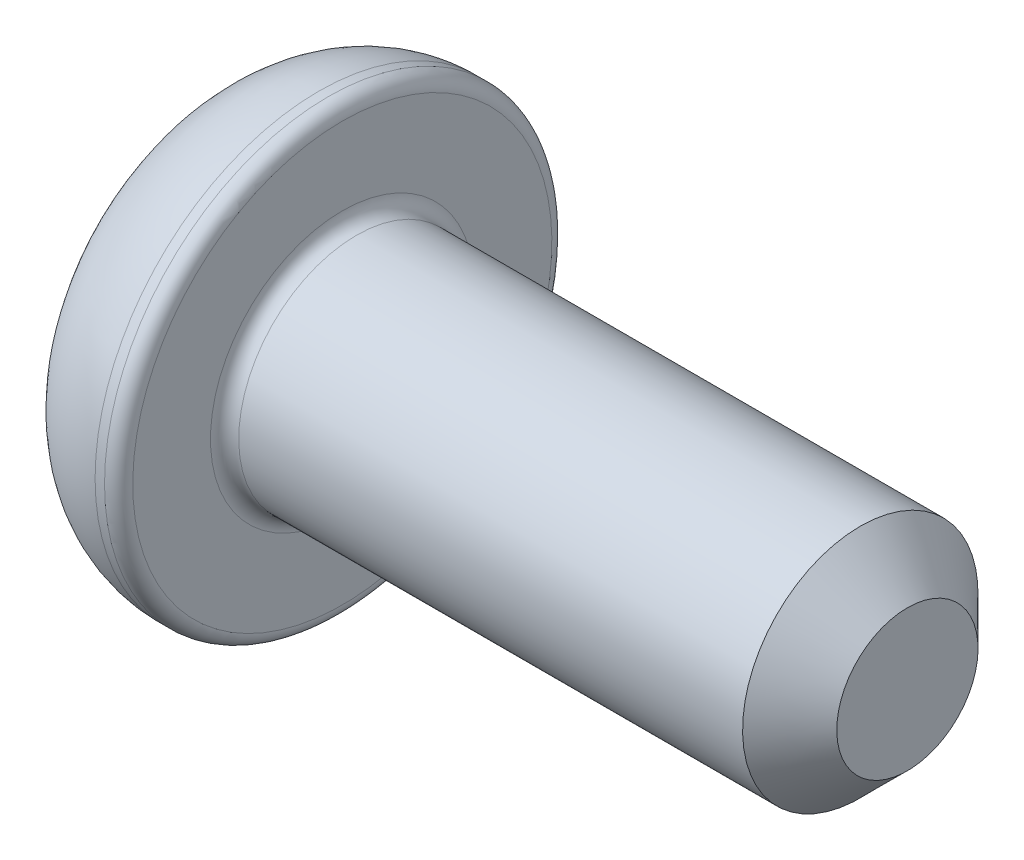
ISO-10303-21;
HEADER;
FILE_DESCRIPTION(('STEP AP214'),'2;1');
FILE_NAME('part.step','',(''),(''),'','','');
FILE_SCHEMA(('AUTOMOTIVE_DESIGN { 1 0 10303 214 1 1 1 1 }'));
ENDSEC;
DATA;
#1=APPLICATION_CONTEXT('core data for automotive mechanical design processes');
#2=APPLICATION_PROTOCOL_DEFINITION('international standard','automotive_design',2000,#1);
#3=PRODUCT_CONTEXT('',#1,'mechanical');
#4=PRODUCT('Part','Part','',(#3));
#5=PRODUCT_RELATED_PRODUCT_CATEGORY('part','',(#4));
#6=PRODUCT_DEFINITION_FORMATION('','',#4);
#7=PRODUCT_DEFINITION_CONTEXT('part definition',#1,'design');
#8=PRODUCT_DEFINITION('design','',#6,#7);
#9=PRODUCT_DEFINITION_SHAPE('','',#8);
#10=(LENGTH_UNIT() NAMED_UNIT(*) SI_UNIT(.MILLI.,.METRE.));
#11=(NAMED_UNIT(*) PLANE_ANGLE_UNIT() SI_UNIT($,.RADIAN.));
#12=(NAMED_UNIT(*) SI_UNIT($,.STERADIAN.) SOLID_ANGLE_UNIT());
#13=UNCERTAINTY_MEASURE_WITH_UNIT(LENGTH_MEASURE(1.E-05),#10,'distance_accuracy_value','');
#14=(GEOMETRIC_REPRESENTATION_CONTEXT(3) GLOBAL_UNCERTAINTY_ASSIGNED_CONTEXT((#13)) GLOBAL_UNIT_ASSIGNED_CONTEXT((#10,
#11,#12)) REPRESENTATION_CONTEXT('',''));
#15=CARTESIAN_POINT('',(0.,0.,0.));
#16=DIRECTION('',(0.,0.,1.));
#17=DIRECTION('',(1.,0.,0.));
#18=AXIS2_PLACEMENT_3D('',#15,#16,#17);
#19=CARTESIAN_POINT('',(0.,0.,0.));
#20=DIRECTION('',(-1.,0.,0.));
#21=DIRECTION('',(0.,-1.,0.));
#22=AXIS2_PLACEMENT_3D('',#19,#20,#21);
#23=PLANE('',#22);
#24=DIRECTION('',(0.,0.866025403784438,-0.5));
#25=VECTOR('',#24,1.);
#26=CARTESIAN_POINT('',(0.,0.,1.73205080756888));
#27=LINE('',#26,#25);
#28=CARTESIAN_POINT('',(0.,0.,1.73205080756888));
#29=VERTEX_POINT('',#28);
#30=CARTESIAN_POINT('',(0.,1.5,0.866025403784438));
#31=VERTEX_POINT('',#30);
#32=EDGE_CURVE('E55',#29,#31,#27,.T.);
#33=ORIENTED_EDGE('',*,*,#32,.F.);
#34=DIRECTION('',(0.,0.866025403784439,0.5));
#35=VECTOR('',#34,1.);
#36=CARTESIAN_POINT('',(0.,-1.5,0.866025403784438));
#37=LINE('',#36,#35);
#38=CARTESIAN_POINT('',(0.,-1.5,0.866025403784438));
#39=VERTEX_POINT('',#38);
#40=EDGE_CURVE('E138',#39,#29,#37,.T.);
#41=ORIENTED_EDGE('',*,*,#40,.F.);
#42=DIRECTION('',(0.,0.,1.));
#43=VECTOR('',#42,1.);
#44=CARTESIAN_POINT('',(0.,-1.5,-0.866025403784439));
#45=LINE('',#44,#43);
#46=CARTESIAN_POINT('',(0.,-1.5,-0.866025403784439));
#47=VERTEX_POINT('',#46);
#48=EDGE_CURVE('E136',#47,#39,#45,.T.);
#49=ORIENTED_EDGE('',*,*,#48,.F.);
#50=DIRECTION('',(0.,-0.866025403784438,0.5));
#51=VECTOR('',#50,1.);
#52=CARTESIAN_POINT('',(0.,0.,-1.73205080756888));
#53=LINE('',#52,#51);
#54=CARTESIAN_POINT('',(0.,0.,-1.73205080756888));
#55=VERTEX_POINT('',#54);
#56=EDGE_CURVE('E103',#55,#47,#53,.T.);
#57=ORIENTED_EDGE('',*,*,#56,.F.);
#58=DIRECTION('',(0.,-0.866025403784439,-0.5));
#59=VECTOR('',#58,1.);
#60=CARTESIAN_POINT('',(0.,1.5,-0.866025403784439));
#61=LINE('',#60,#59);
#62=CARTESIAN_POINT('',(0.,1.5,-0.866025403784439));
#63=VERTEX_POINT('',#62);
#64=EDGE_CURVE('E132',#63,#55,#61,.T.);
#65=ORIENTED_EDGE('',*,*,#64,.F.);
#66=DIRECTION('',(0.,0.,-1.));
#67=VECTOR('',#66,1.);
#68=CARTESIAN_POINT('',(0.,1.5,0.866025403784438));
#69=LINE('',#68,#67);
#70=EDGE_CURVE('E129',#31,#63,#69,.T.);
#71=ORIENTED_EDGE('',*,*,#70,.F.);
#72=EDGE_LOOP('',(#33,#41,#49,#57,#65,#71));
#73=FACE_BOUND('',#72,.T.);
#74=CARTESIAN_POINT('',(0.,0.,0.));
#75=DIRECTION('',(1.,0.,0.));
#76=DIRECTION('',(0.,1.,0.));
#77=AXIS2_PLACEMENT_3D('',#74,#75,#76);
#78=CIRCLE('',#77,3.625);
#79=CARTESIAN_POINT('',(0.,3.625,0.));
#80=VERTEX_POINT('',#79);
#81=EDGE_CURVE('E150',#80,#80,#78,.T.);
#82=ORIENTED_EDGE('',*,*,#81,.F.);
#83=EDGE_LOOP('',(#82));
#84=FACE_BOUND('',#83,.T.);
#85=ADVANCED_FACE('F39',(#73,#84),#23,.T.);
#86=CARTESIAN_POINT('',(2.1,0.,0.));
#87=DIRECTION('',(1.,0.,0.));
#88=DIRECTION('',(0.,1.,0.));
#89=AXIS2_PLACEMENT_3D('',#86,#87,#88);
#90=DEGENERATE_TOROIDAL_SURFACE('',#89,2.2275,2.5225,.T.);
#91=ORIENTED_EDGE('',*,*,#81,.T.);
#92=EDGE_LOOP('',(#91));
#93=FACE_BOUND('',#92,.T.);
#94=CARTESIAN_POINT('',(2.1,0.,0.));
#95=DIRECTION('',(1.,0.,0.));
#96=DIRECTION('',(0.,1.,0.));
#97=AXIS2_PLACEMENT_3D('',#94,#95,#96);
#98=CIRCLE('',#97,4.75);
#99=CARTESIAN_POINT('',(2.1,4.75,0.));
#100=VERTEX_POINT('',#99);
#101=EDGE_CURVE('E142',#100,#100,#98,.T.);
#102=ORIENTED_EDGE('',*,*,#101,.F.);
#103=EDGE_LOOP('',(#102));
#104=FACE_BOUND('',#103,.T.);
#105=ADVANCED_FACE('F179',(#93,#104),#90,.T.);
#106=CARTESIAN_POINT('',(14.6,0.,0.));
#107=DIRECTION('',(1.,0.,0.));
#108=DIRECTION('',(0.,1.,0.));
#109=AXIS2_PLACEMENT_3D('',#106,#107,#108);
#110=CYLINDRICAL_SURFACE('',#109,4.75);
#111=CARTESIAN_POINT('',(2.3,0.,0.));
#112=DIRECTION('',(1.,0.,0.));
#113=DIRECTION('',(0.,1.,0.));
#114=AXIS2_PLACEMENT_3D('',#111,#112,#113);
#115=CIRCLE('',#114,4.75);
#116=CARTESIAN_POINT('',(2.3,4.75,0.));
#117=VERTEX_POINT('',#116);
#118=EDGE_CURVE('E162',#117,#117,#115,.F.);
#119=ORIENTED_EDGE('',*,*,#118,.T.);
#120=EDGE_LOOP('',(#119));
#121=FACE_BOUND('',#120,.T.);
#122=ORIENTED_EDGE('',*,*,#101,.T.);
#123=EDGE_LOOP('',(#122));
#124=FACE_BOUND('',#123,.T.);
#125=ADVANCED_FACE('F185',(#121,#124),#110,.T.);
#126=CARTESIAN_POINT('',(2.6,4.75,0.));
#127=DIRECTION('',(1.,0.,0.));
#128=DIRECTION('',(0.,1.,0.));
#129=AXIS2_PLACEMENT_3D('',#126,#127,#128);
#130=PLANE('',#129);
#131=CARTESIAN_POINT('',(2.6,0.,0.));
#132=DIRECTION('',(1.,0.,0.));
#133=DIRECTION('',(0.,1.,0.));
#134=AXIS2_PLACEMENT_3D('',#131,#132,#133);
#135=CIRCLE('',#134,2.8);
#136=CARTESIAN_POINT('',(2.6,2.8,0.));
#137=VERTEX_POINT('',#136);
#138=EDGE_CURVE('E159',#137,#137,#135,.F.);
#139=ORIENTED_EDGE('',*,*,#138,.T.);
#140=EDGE_LOOP('',(#139));
#141=FACE_BOUND('',#140,.T.);
#142=CARTESIAN_POINT('',(2.6,0.,0.));
#143=DIRECTION('',(1.,0.,0.));
#144=DIRECTION('',(0.,1.,0.));
#145=AXIS2_PLACEMENT_3D('',#142,#143,#144);
#146=CIRCLE('',#145,4.45);
#147=CARTESIAN_POINT('',(2.6,4.45,0.));
#148=VERTEX_POINT('',#147);
#149=EDGE_CURVE('E156',#148,#148,#146,.T.);
#150=ORIENTED_EDGE('',*,*,#149,.T.);
#151=EDGE_LOOP('',(#150));
#152=FACE_BOUND('',#151,.T.);
#153=ADVANCED_FACE('F204',(#141,#152),#130,.T.);
#154=CARTESIAN_POINT('',(14.6,0.,0.));
#155=DIRECTION('',(1.,0.,0.));
#156=DIRECTION('',(0.,1.,0.));
#157=AXIS2_PLACEMENT_3D('',#154,#155,#156);
#158=CYLINDRICAL_SURFACE('',#157,2.5);
#159=CARTESIAN_POINT('',(13.6,0.,0.));
#160=DIRECTION('',(1.,0.,0.));
#161=DIRECTION('',(0.,1.,0.));
#162=AXIS2_PLACEMENT_3D('',#159,#160,#161);
#163=CIRCLE('',#162,2.5);
#164=CARTESIAN_POINT('',(13.6,2.5,0.));
#165=VERTEX_POINT('',#164);
#166=EDGE_CURVE('E11',#165,#165,#163,.F.);
#167=ORIENTED_EDGE('',*,*,#166,.T.);
#168=EDGE_LOOP('',(#167));
#169=FACE_BOUND('',#168,.T.);
#170=CARTESIAN_POINT('',(2.9,0.,0.));
#171=DIRECTION('',(1.,0.,0.));
#172=DIRECTION('',(0.,1.,0.));
#173=AXIS2_PLACEMENT_3D('',#170,#171,#172);
#174=CIRCLE('',#173,2.5);
#175=CARTESIAN_POINT('',(2.9,2.5,0.));
#176=VERTEX_POINT('',#175);
#177=EDGE_CURVE('E153',#176,#176,#174,.T.);
#178=ORIENTED_EDGE('',*,*,#177,.T.);
#179=EDGE_LOOP('',(#178));
#180=FACE_BOUND('',#179,.T.);
#181=ADVANCED_FACE('F202',(#169,#180),#158,.T.);
#182=CARTESIAN_POINT('',(14.6,2.5,0.));
#183=DIRECTION('',(1.,0.,0.));
#184=DIRECTION('',(0.,1.,0.));
#185=AXIS2_PLACEMENT_3D('',#182,#183,#184);
#186=PLANE('',#185);
#187=CARTESIAN_POINT('',(14.6,0.,0.));
#188=DIRECTION('',(1.,0.,0.));
#189=DIRECTION('',(0.,1.,0.));
#190=AXIS2_PLACEMENT_3D('',#187,#188,#189);
#191=CIRCLE('',#190,1.5);
#192=CARTESIAN_POINT('',(14.6,1.5,0.));
#193=VERTEX_POINT('',#192);
#194=EDGE_CURVE('E48',#193,#193,#191,.T.);
#195=ORIENTED_EDGE('',*,*,#194,.T.);
#196=EDGE_LOOP('',(#195));
#197=FACE_BOUND('',#196,.T.);
#198=ADVANCED_FACE('F167',(#197),#186,.T.);
#199=CARTESIAN_POINT('',(1.5,0.,1.73205080756888));
#200=DIRECTION('',(0.,0.5,0.866025403784439));
#201=DIRECTION('',(0.,-0.866025403784439,0.5));
#202=AXIS2_PLACEMENT_3D('',#199,#200,#201);
#203=PLANE('',#202);
#204=ORIENTED_EDGE('',*,*,#32,.T.);
#205=DIRECTION('',(-1.,0.,0.));
#206=VECTOR('',#205,1.);
#207=CARTESIAN_POINT('',(1.5,1.5,0.866025403784438));
#208=LINE('',#207,#206);
#209=CARTESIAN_POINT('',(1.5,1.5,0.866025403784438));
#210=VERTEX_POINT('',#209);
#211=EDGE_CURVE('E85',#210,#31,#208,.T.);
#212=ORIENTED_EDGE('',*,*,#211,.F.);
#213=DIRECTION('',(0.,0.866025403784438,-0.5));
#214=VECTOR('',#213,1.);
#215=CARTESIAN_POINT('',(1.5,0.,1.73205080756888));
#216=LINE('',#215,#214);
#217=CARTESIAN_POINT('',(1.5,0.,1.73205080756888));
#218=VERTEX_POINT('',#217);
#219=EDGE_CURVE('E140',#218,#210,#216,.T.);
#220=ORIENTED_EDGE('',*,*,#219,.F.);
#221=DIRECTION('',(-1.,0.,0.));
#222=VECTOR('',#221,1.);
#223=CARTESIAN_POINT('',(1.5,0.,1.73205080756888));
#224=LINE('',#223,#222);
#225=EDGE_CURVE('E63',#218,#29,#224,.T.);
#226=ORIENTED_EDGE('',*,*,#225,.T.);
#227=EDGE_LOOP('',(#204,#212,#220,#226));
#228=FACE_BOUND('',#227,.T.);
#229=ADVANCED_FACE('F211',(#228),#203,.F.);
#230=CARTESIAN_POINT('',(1.5,-1.5,0.866025403784438));
#231=DIRECTION('',(0.,-0.5,0.866025403784438));
#232=DIRECTION('',(0.,-0.866025403784439,-0.5));
#233=AXIS2_PLACEMENT_3D('',#230,#231,#232);
#234=PLANE('',#233);
#235=ORIENTED_EDGE('',*,*,#40,.T.);
#236=ORIENTED_EDGE('',*,*,#225,.F.);
#237=DIRECTION('',(0.,0.866025403784439,0.5));
#238=VECTOR('',#237,1.);
#239=CARTESIAN_POINT('',(1.5,-1.5,0.866025403784438));
#240=LINE('',#239,#238);
#241=CARTESIAN_POINT('',(1.5,-1.5,0.866025403784438));
#242=VERTEX_POINT('',#241);
#243=EDGE_CURVE('E115',#242,#218,#240,.T.);
#244=ORIENTED_EDGE('',*,*,#243,.F.);
#245=DIRECTION('',(-1.,0.,0.));
#246=VECTOR('',#245,1.);
#247=CARTESIAN_POINT('',(1.5,-1.5,0.866025403784438));
#248=LINE('',#247,#246);
#249=EDGE_CURVE('E107',#242,#39,#248,.T.);
#250=ORIENTED_EDGE('',*,*,#249,.T.);
#251=EDGE_LOOP('',(#235,#236,#244,#250));
#252=FACE_BOUND('',#251,.T.);
#253=ADVANCED_FACE('F270',(#252),#234,.F.);
#254=CARTESIAN_POINT('',(1.5,-1.5,-0.866025403784439));
#255=DIRECTION('',(0.,-1.,0.));
#256=DIRECTION('',(0.,0.,-1.));
#257=AXIS2_PLACEMENT_3D('',#254,#255,#256);
#258=PLANE('',#257);
#259=ORIENTED_EDGE('',*,*,#48,.T.);
#260=ORIENTED_EDGE('',*,*,#249,.F.);
#261=DIRECTION('',(0.,0.,1.));
#262=VECTOR('',#261,1.);
#263=CARTESIAN_POINT('',(1.5,-1.5,-0.866025403784439));
#264=LINE('',#263,#262);
#265=CARTESIAN_POINT('',(1.5,-1.5,-0.866025403784439));
#266=VERTEX_POINT('',#265);
#267=EDGE_CURVE('E111',#266,#242,#264,.T.);
#268=ORIENTED_EDGE('',*,*,#267,.F.);
#269=DIRECTION('',(-1.,0.,0.));
#270=VECTOR('',#269,1.);
#271=CARTESIAN_POINT('',(1.5,-1.5,-0.866025403784439));
#272=LINE('',#271,#270);
#273=EDGE_CURVE('E96',#266,#47,#272,.T.);
#274=ORIENTED_EDGE('',*,*,#273,.T.);
#275=EDGE_LOOP('',(#259,#260,#268,#274));
#276=FACE_BOUND('',#275,.T.);
#277=ADVANCED_FACE('F112',(#276),#258,.F.);
#278=CARTESIAN_POINT('',(1.5,0.,-1.73205080756888));
#279=DIRECTION('',(0.,-0.5,-0.866025403784439));
#280=DIRECTION('',(0.,0.866025403784439,-0.5));
#281=AXIS2_PLACEMENT_3D('',#278,#279,#280);
#282=PLANE('',#281);
#283=ORIENTED_EDGE('',*,*,#56,.T.);
#284=ORIENTED_EDGE('',*,*,#273,.F.);
#285=DIRECTION('',(0.,-0.866025403784438,0.5));
#286=VECTOR('',#285,1.);
#287=CARTESIAN_POINT('',(1.5,0.,-1.73205080756888));
#288=LINE('',#287,#286);
#289=CARTESIAN_POINT('',(1.5,0.,-1.73205080756888));
#290=VERTEX_POINT('',#289);
#291=EDGE_CURVE('E100',#290,#266,#288,.T.);
#292=ORIENTED_EDGE('',*,*,#291,.F.);
#293=DIRECTION('',(-1.,0.,0.));
#294=VECTOR('',#293,1.);
#295=CARTESIAN_POINT('',(1.5,0.,-1.73205080756888));
#296=LINE('',#295,#294);
#297=EDGE_CURVE('E108',#290,#55,#296,.T.);
#298=ORIENTED_EDGE('',*,*,#297,.T.);
#299=EDGE_LOOP('',(#283,#284,#292,#298));
#300=FACE_BOUND('',#299,.T.);
#301=ADVANCED_FACE('F98',(#300),#282,.F.);
#302=CARTESIAN_POINT('',(1.5,1.5,-0.866025403784439));
#303=DIRECTION('',(0.,0.5,-0.866025403784439));
#304=DIRECTION('',(0.,0.866025403784439,0.5));
#305=AXIS2_PLACEMENT_3D('',#302,#303,#304);
#306=PLANE('',#305);
#307=ORIENTED_EDGE('',*,*,#64,.T.);
#308=ORIENTED_EDGE('',*,*,#297,.F.);
#309=DIRECTION('',(0.,-0.866025403784439,-0.5));
#310=VECTOR('',#309,1.);
#311=CARTESIAN_POINT('',(1.5,1.5,-0.866025403784439));
#312=LINE('',#311,#310);
#313=CARTESIAN_POINT('',(1.5,1.5,-0.866025403784439));
#314=VERTEX_POINT('',#313);
#315=EDGE_CURVE('E121',#314,#290,#312,.T.);
#316=ORIENTED_EDGE('',*,*,#315,.F.);
#317=DIRECTION('',(-1.,0.,0.));
#318=VECTOR('',#317,1.);
#319=CARTESIAN_POINT('',(1.5,1.5,-0.866025403784439));
#320=LINE('',#319,#318);
#321=EDGE_CURVE('E145',#314,#63,#320,.T.);
#322=ORIENTED_EDGE('',*,*,#321,.T.);
#323=EDGE_LOOP('',(#307,#308,#316,#322));
#324=FACE_BOUND('',#323,.T.);
#325=ADVANCED_FACE('F287',(#324),#306,.F.);
#326=CARTESIAN_POINT('',(1.5,1.5,0.866025403784438));
#327=DIRECTION('',(0.,1.,0.));
#328=DIRECTION('',(0.,0.,1.));
#329=AXIS2_PLACEMENT_3D('',#326,#327,#328);
#330=PLANE('',#329);
#331=ORIENTED_EDGE('',*,*,#70,.T.);
#332=ORIENTED_EDGE('',*,*,#321,.F.);
#333=DIRECTION('',(0.,0.,-1.));
#334=VECTOR('',#333,1.);
#335=CARTESIAN_POINT('',(1.5,1.5,0.866025403784438));
#336=LINE('',#335,#334);
#337=EDGE_CURVE('E123',#210,#314,#336,.T.);
#338=ORIENTED_EDGE('',*,*,#337,.F.);
#339=ORIENTED_EDGE('',*,*,#211,.T.);
#340=EDGE_LOOP('',(#331,#332,#338,#339));
#341=FACE_BOUND('',#340,.T.);
#342=ADVANCED_FACE('F196',(#341),#330,.F.);
#343=CARTESIAN_POINT('',(1.5,0.,0.));
#344=DIRECTION('',(-1.,0.,0.));
#345=DIRECTION('',(0.,0.,1.));
#346=AXIS2_PLACEMENT_3D('',#343,#344,#345);
#347=PLANE('',#346);
#348=ORIENTED_EDGE('',*,*,#219,.T.);
#349=ORIENTED_EDGE('',*,*,#337,.T.);
#350=ORIENTED_EDGE('',*,*,#315,.T.);
#351=ORIENTED_EDGE('',*,*,#291,.T.);
#352=ORIENTED_EDGE('',*,*,#267,.T.);
#353=ORIENTED_EDGE('',*,*,#243,.T.);
#354=EDGE_LOOP('',(#348,#349,#350,#351,#352,#353));
#355=FACE_BOUND('',#354,.T.);
#356=ADVANCED_FACE('F118',(#355),#347,.T.);
#357=CARTESIAN_POINT('',(2.9,0.,0.));
#358=DIRECTION('',(1.,0.,0.));
#359=DIRECTION('',(0.,1.,0.));
#360=AXIS2_PLACEMENT_3D('',#357,#358,#359);
#361=TOROIDAL_SURFACE('',#360,2.8,0.3);
#362=ORIENTED_EDGE('',*,*,#138,.F.);
#363=EDGE_LOOP('',(#362));
#364=FACE_BOUND('',#363,.T.);
#365=ORIENTED_EDGE('',*,*,#177,.F.);
#366=EDGE_LOOP('',(#365));
#367=FACE_BOUND('',#366,.T.);
#368=ADVANCED_FACE('F175',(#364,#367),#361,.F.);
#369=CARTESIAN_POINT('',(2.3,0.,0.));
#370=DIRECTION('',(1.,0.,0.));
#371=DIRECTION('',(0.,1.,0.));
#372=AXIS2_PLACEMENT_3D('',#369,#370,#371);
#373=TOROIDAL_SURFACE('',#372,4.45,0.3);
#374=ORIENTED_EDGE('',*,*,#118,.F.);
#375=EDGE_LOOP('',(#374));
#376=FACE_BOUND('',#375,.T.);
#377=ORIENTED_EDGE('',*,*,#149,.F.);
#378=EDGE_LOOP('',(#377));
#379=FACE_BOUND('',#378,.T.);
#380=ADVANCED_FACE('F170',(#376,#379),#373,.T.);
#381=CARTESIAN_POINT('',(14.6,0.,0.));
#382=DIRECTION('',(-1.,0.,0.));
#383=DIRECTION('',(0.,-1.,0.));
#384=AXIS2_PLACEMENT_3D('',#381,#382,#383);
#385=CONICAL_SURFACE('',#384,1.5,0.785398163397446);
#386=ORIENTED_EDGE('',*,*,#166,.F.);
#387=EDGE_LOOP('',(#386));
#388=FACE_BOUND('',#387,.T.);
#389=ORIENTED_EDGE('',*,*,#194,.F.);
#390=EDGE_LOOP('',(#389));
#391=FACE_BOUND('',#390,.T.);
#392=ADVANCED_FACE('F42',(#388,#391),#385,.T.);
#393=CLOSED_SHELL('',(#85,#105,#125,#153,#181,#198,#229,#253,#277,#301,#325,#342,#356,#368,#380,#392));
#394=MANIFOLD_SOLID_BREP('B2',#393);
#395=ADVANCED_BREP_SHAPE_REPRESENTATION('',(#18,#394),#14);
#396=SHAPE_DEFINITION_REPRESENTATION(#9,#395);
ENDSEC;
END-ISO-10303-21;
